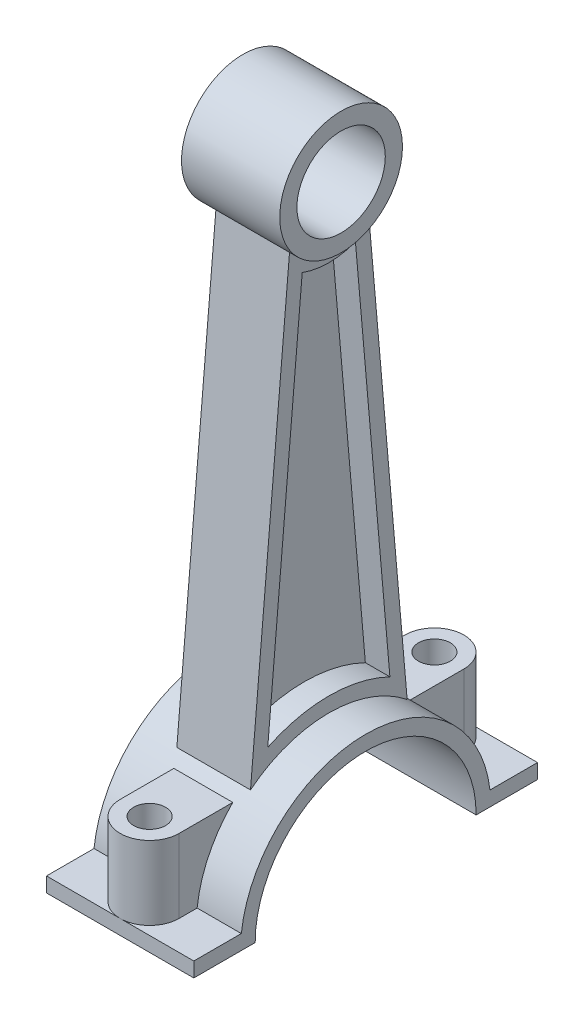
ISO-10303-21;
HEADER;
FILE_DESCRIPTION(('STEP AP214'),'2;1');
FILE_NAME('part.step','',(''),(''),'','','');
FILE_SCHEMA(('AUTOMOTIVE_DESIGN { 1 0 10303 214 1 1 1 1 }'));
ENDSEC;
DATA;
#1=APPLICATION_CONTEXT('core data for automotive mechanical design processes');
#2=APPLICATION_PROTOCOL_DEFINITION('international standard','automotive_design',2000,#1);
#3=PRODUCT_CONTEXT('',#1,'mechanical');
#4=PRODUCT('Part','Part','',(#3));
#5=PRODUCT_RELATED_PRODUCT_CATEGORY('part','',(#4));
#6=PRODUCT_DEFINITION_FORMATION('','',#4);
#7=PRODUCT_DEFINITION_CONTEXT('part definition',#1,'design');
#8=PRODUCT_DEFINITION('design','',#6,#7);
#9=PRODUCT_DEFINITION_SHAPE('','',#8);
#10=(LENGTH_UNIT() NAMED_UNIT(*) SI_UNIT(.MILLI.,.METRE.));
#11=(NAMED_UNIT(*) PLANE_ANGLE_UNIT() SI_UNIT($,.RADIAN.));
#12=(NAMED_UNIT(*) SI_UNIT($,.STERADIAN.) SOLID_ANGLE_UNIT());
#13=UNCERTAINTY_MEASURE_WITH_UNIT(LENGTH_MEASURE(1.E-05),#10,'distance_accuracy_value','');
#14=(GEOMETRIC_REPRESENTATION_CONTEXT(3) GLOBAL_UNCERTAINTY_ASSIGNED_CONTEXT((#13)) GLOBAL_UNIT_ASSIGNED_CONTEXT((#10,
#11,#12)) REPRESENTATION_CONTEXT('',''));
#15=CARTESIAN_POINT('',(0.,0.,0.));
#16=DIRECTION('',(0.,0.,1.));
#17=DIRECTION('',(1.,0.,0.));
#18=AXIS2_PLACEMENT_3D('',#15,#16,#17);
#19=CARTESIAN_POINT('',(7.5,0.,0.));
#20=DIRECTION('',(1.,0.,0.));
#21=DIRECTION('',(0.,0.,-1.));
#22=AXIS2_PLACEMENT_3D('',#19,#20,#21);
#23=PLANE('',#22);
#24=CARTESIAN_POINT('',(7.5,-120.4,0.));
#25=DIRECTION('',(1.,0.,0.));
#26=DIRECTION('',(0.,0.,-1.));
#27=AXIS2_PLACEMENT_3D('',#24,#25,#26);
#28=CIRCLE('',#27,25.5);
#29=CARTESIAN_POINT('',(7.5,-100.506382816849,-15.9528679355858));
#30=VERTEX_POINT('',#29);
#31=CARTESIAN_POINT('',(7.5,-100.506382816849,15.9528679355858));
#32=VERTEX_POINT('',#31);
#33=EDGE_CURVE('E426',#30,#32,#28,.T.);
#34=ORIENTED_EDGE('',*,*,#33,.F.);
#35=DIRECTION('',(0.,-0.996194698091746,-0.0871557427476582));
#36=VECTOR('',#35,1.);
#37=CARTESIAN_POINT('',(7.5,0.621634326986274,-7.10531287064495));
#38=LINE('',#37,#36);
#39=CARTESIAN_POINT('',(7.5,-9.60468635614928,-8.));
#40=VERTEX_POINT('',#39);
#41=EDGE_CURVE('E428',#40,#30,#38,.T.);
#42=ORIENTED_EDGE('',*,*,#41,.F.);
#43=CARTESIAN_POINT('',(7.5,0.,0.));
#44=DIRECTION('',(1.,0.,0.));
#45=DIRECTION('',(0.,0.,-1.));
#46=AXIS2_PLACEMENT_3D('',#43,#44,#45);
#47=CIRCLE('',#46,12.5);
#48=CARTESIAN_POINT('',(7.5,-9.60468635614928,8.));
#49=VERTEX_POINT('',#48);
#50=EDGE_CURVE('E432',#49,#40,#47,.T.);
#51=ORIENTED_EDGE('',*,*,#50,.F.);
#52=DIRECTION('',(0.,-0.996194698091746,0.0871557427476582));
#53=VECTOR('',#52,1.);
#54=CARTESIAN_POINT('',(7.5,0.621634326986274,7.10531287064495));
#55=LINE('',#54,#53);
#56=EDGE_CURVE('E434',#49,#32,#55,.T.);
#57=ORIENTED_EDGE('',*,*,#56,.T.);
#58=EDGE_LOOP('',(#34,#42,#51,#57));
#59=FACE_BOUND('',#58,.T.);
#60=DIRECTION('',(0.,-0.996194698091746,-0.0871557427476582));
#61=VECTOR('',#60,1.);
#62=CARTESIAN_POINT('',(7.5,0.360167098743299,-4.11672877636972));
#63=LINE('',#62,#61);
#64=CARTESIAN_POINT('',(7.5,-14.5219555829309,-5.41874580021823));
#65=VERTEX_POINT('',#64);
#66=CARTESIAN_POINT('',(7.5,-94.7575560761521,-12.4384512545701));
#67=VERTEX_POINT('',#66);
#68=EDGE_CURVE('E277',#65,#67,#63,.T.);
#69=ORIENTED_EDGE('',*,*,#68,.T.);
#70=CARTESIAN_POINT('',(7.5,-120.4,0.));
#71=DIRECTION('',(1.,0.,0.));
#72=DIRECTION('',(0.,0.,-1.));
#73=AXIS2_PLACEMENT_3D('',#70,#71,#72);
#74=CIRCLE('',#73,28.5);
#75=CARTESIAN_POINT('',(7.5,-94.7575560761521,12.4384512545701));
#76=VERTEX_POINT('',#75);
#77=EDGE_CURVE('E58',#67,#76,#74,.T.);
#78=ORIENTED_EDGE('',*,*,#77,.T.);
#79=DIRECTION('',(0.,-0.996194698091746,0.0871557427476582));
#80=VECTOR('',#79,1.);
#81=CARTESIAN_POINT('',(7.5,0.360167098743299,4.11672877636972));
#82=LINE('',#81,#80);
#83=CARTESIAN_POINT('',(7.5,-14.5219555829309,5.41874580021823));
#84=VERTEX_POINT('',#83);
#85=EDGE_CURVE('E268',#84,#76,#82,.T.);
#86=ORIENTED_EDGE('',*,*,#85,.F.);
#87=CARTESIAN_POINT('',(7.5,0.,0.));
#88=DIRECTION('',(1.,0.,0.));
#89=DIRECTION('',(0.,0.,-1.));
#90=AXIS2_PLACEMENT_3D('',#87,#88,#89);
#91=CIRCLE('',#90,15.5);
#92=EDGE_CURVE('E280',#84,#65,#91,.T.);
#93=ORIENTED_EDGE('',*,*,#92,.T.);
#94=EDGE_LOOP('',(#69,#78,#86,#93));
#95=FACE_BOUND('',#94,.T.);
#96=ADVANCED_FACE('F35',(#59,#95),#23,.T.);
#97=CARTESIAN_POINT('',(15.,-117.4,25.3229145242012));
#98=DIRECTION('',(0.,-1.,0.));
#99=DIRECTION('',(0.,0.,-1.));
#100=AXIS2_PLACEMENT_3D('',#97,#98,#99);
#101=PLANE('',#100);
#102=DIRECTION('',(-1.,0.,0.));
#103=VECTOR('',#102,1.);
#104=CARTESIAN_POINT('',(15.,-117.4,25.3229145242012));
#105=LINE('',#104,#103);
#106=CARTESIAN_POINT('',(15.,-117.4,25.3229145242012));
#107=VERTEX_POINT('',#106);
#108=CARTESIAN_POINT('',(6.,-117.4,25.3229145242012));
#109=VERTEX_POINT('',#108);
#110=EDGE_CURVE('E406',#107,#109,#105,.T.);
#111=ORIENTED_EDGE('',*,*,#110,.T.);
#112=DIRECTION('',(0.,0.,1.));
#113=VECTOR('',#112,1.);
#114=CARTESIAN_POINT('',(6.,-117.4,29.));
#115=LINE('',#114,#113);
#116=CARTESIAN_POINT('',(6.,-117.4,29.));
#117=VERTEX_POINT('',#116);
#118=EDGE_CURVE('E296',#109,#117,#115,.T.);
#119=ORIENTED_EDGE('',*,*,#118,.T.);
#120=CARTESIAN_POINT('',(0.,-117.4,29.));
#121=DIRECTION('',(0.,-1.,0.));
#122=DIRECTION('',(0.,0.,-1.));
#123=AXIS2_PLACEMENT_3D('',#120,#121,#122);
#124=CIRCLE('',#123,6.);
#125=CARTESIAN_POINT('',(0.,-117.4,35.));
#126=VERTEX_POINT('',#125);
#127=EDGE_CURVE('E302',#117,#126,#124,.T.);
#128=ORIENTED_EDGE('',*,*,#127,.T.);
#129=DIRECTION('',(-1.,0.,0.));
#130=VECTOR('',#129,1.);
#131=CARTESIAN_POINT('',(15.,-117.4,35.));
#132=LINE('',#131,#130);
#133=CARTESIAN_POINT('',(15.,-117.4,35.));
#134=VERTEX_POINT('',#133);
#135=EDGE_CURVE('E410',#134,#126,#132,.T.);
#136=ORIENTED_EDGE('',*,*,#135,.F.);
#137=DIRECTION('',(0.,0.,1.));
#138=VECTOR('',#137,1.);
#139=CARTESIAN_POINT('',(15.,-117.4,25.3229145242012));
#140=LINE('',#139,#138);
#141=EDGE_CURVE('E375',#107,#134,#140,.T.);
#142=ORIENTED_EDGE('',*,*,#141,.F.);
#143=EDGE_LOOP('',(#111,#119,#128,#136,#142));
#144=FACE_BOUND('',#143,.T.);
#145=ADVANCED_FACE('F516',(#144),#101,.F.);
#146=CARTESIAN_POINT('',(15.,-117.4,-25.3229145242012));
#147=DIRECTION('',(0.,1.,0.));
#148=DIRECTION('',(0.,0.,1.));
#149=AXIS2_PLACEMENT_3D('',#146,#147,#148);
#150=PLANE('',#149);
#151=CARTESIAN_POINT('',(0.,-117.4,-29.));
#152=DIRECTION('',(0.,1.,0.));
#153=DIRECTION('',(0.,0.,1.));
#154=AXIS2_PLACEMENT_3D('',#151,#152,#153);
#155=CIRCLE('',#154,6.);
#156=CARTESIAN_POINT('',(6.,-117.4,-29.));
#157=VERTEX_POINT('',#156);
#158=CARTESIAN_POINT('',(0.,-117.4,-35.));
#159=VERTEX_POINT('',#158);
#160=EDGE_CURVE('E344',#157,#159,#155,.T.);
#161=ORIENTED_EDGE('',*,*,#160,.F.);
#162=DIRECTION('',(0.,0.,-1.));
#163=VECTOR('',#162,1.);
#164=CARTESIAN_POINT('',(6.,-117.4,-29.));
#165=LINE('',#164,#163);
#166=CARTESIAN_POINT('',(6.,-117.4,-25.3229145242012));
#167=VERTEX_POINT('',#166);
#168=EDGE_CURVE('E331',#167,#157,#165,.T.);
#169=ORIENTED_EDGE('',*,*,#168,.F.);
#170=DIRECTION('',(-1.,0.,0.));
#171=VECTOR('',#170,1.);
#172=CARTESIAN_POINT('',(15.,-117.4,-25.3229145242012));
#173=LINE('',#172,#171);
#174=CARTESIAN_POINT('',(15.,-117.4,-25.3229145242012));
#175=VERTEX_POINT('',#174);
#176=EDGE_CURVE('E401',#175,#167,#173,.T.);
#177=ORIENTED_EDGE('',*,*,#176,.F.);
#178=DIRECTION('',(0.,0.,-1.));
#179=VECTOR('',#178,1.);
#180=CARTESIAN_POINT('',(15.,-117.4,-25.3229145242012));
#181=LINE('',#180,#179);
#182=CARTESIAN_POINT('',(15.,-117.4,-35.));
#183=VERTEX_POINT('',#182);
#184=EDGE_CURVE('E358',#175,#183,#181,.T.);
#185=ORIENTED_EDGE('',*,*,#184,.T.);
#186=DIRECTION('',(-1.,0.,0.));
#187=VECTOR('',#186,1.);
#188=CARTESIAN_POINT('',(15.,-117.4,-35.));
#189=LINE('',#188,#187);
#190=EDGE_CURVE('E423',#183,#159,#189,.T.);
#191=ORIENTED_EDGE('',*,*,#190,.T.);
#192=EDGE_LOOP('',(#161,#169,#177,#185,#191));
#193=FACE_BOUND('',#192,.T.);
#194=ADVANCED_FACE('F489',(#193),#150,.T.);
#195=DIRECTION('',(0.,0.,1.));
#196=VECTOR('',#195,1.);
#197=CARTESIAN_POINT('',(-6.,-117.4,-29.));
#198=LINE('',#197,#196);
#199=CARTESIAN_POINT('',(-6.,-117.4,-29.));
#200=VERTEX_POINT('',#199);
#201=CARTESIAN_POINT('',(-6.,-117.4,-25.3229145242012));
#202=VERTEX_POINT('',#201);
#203=EDGE_CURVE('E337',#200,#202,#198,.T.);
#204=ORIENTED_EDGE('',*,*,#203,.F.);
#205=EDGE_CURVE('E343',#159,#200,#155,.T.);
#206=ORIENTED_EDGE('',*,*,#205,.F.);
#207=CARTESIAN_POINT('',(-15.,-117.4,-35.));
#208=VERTEX_POINT('',#207);
#209=EDGE_CURVE('E379',#159,#208,#189,.T.);
#210=ORIENTED_EDGE('',*,*,#209,.T.);
#211=DIRECTION('',(0.,0.,-1.));
#212=VECTOR('',#211,1.);
#213=CARTESIAN_POINT('',(-15.,-117.4,-25.3229145242012));
#214=LINE('',#213,#212);
#215=CARTESIAN_POINT('',(-15.,-117.4,-25.3229145242012));
#216=VERTEX_POINT('',#215);
#217=EDGE_CURVE('E357',#216,#208,#214,.T.);
#218=ORIENTED_EDGE('',*,*,#217,.F.);
#219=EDGE_CURVE('E405',#202,#216,#173,.T.);
#220=ORIENTED_EDGE('',*,*,#219,.F.);
#221=EDGE_LOOP('',(#204,#206,#210,#218,#220));
#222=FACE_BOUND('',#221,.T.);
#223=ADVANCED_FACE('F500',(#222),#150,.T.);
#224=CARTESIAN_POINT('',(15.,-120.4,0.));
#225=DIRECTION('',(-1.,0.,0.));
#226=DIRECTION('',(0.,0.,1.));
#227=AXIS2_PLACEMENT_3D('',#224,#225,#226);
#228=CYLINDRICAL_SURFACE('',#227,25.5);
#229=ORIENTED_EDGE('',*,*,#33,.T.);
#230=DIRECTION('',(-1.,0.,0.));
#231=VECTOR('',#230,1.);
#232=CARTESIAN_POINT('',(7.5,-100.506382816849,15.9528679355858));
#233=LINE('',#232,#231);
#234=CARTESIAN_POINT('',(-7.5,-100.506382816849,15.9528679355858));
#235=VERTEX_POINT('',#234);
#236=EDGE_CURVE('E437',#32,#235,#233,.T.);
#237=ORIENTED_EDGE('',*,*,#236,.T.);
#238=CARTESIAN_POINT('',(-7.5,-120.4,0.));
#239=DIRECTION('',(1.,0.,0.));
#240=DIRECTION('',(0.,0.,-1.));
#241=AXIS2_PLACEMENT_3D('',#238,#239,#240);
#242=CIRCLE('',#241,25.5);
#243=CARTESIAN_POINT('',(-7.5,-100.506382816849,-15.9528679355859));
#244=VERTEX_POINT('',#243);
#245=EDGE_CURVE('E404',#244,#235,#242,.T.);
#246=ORIENTED_EDGE('',*,*,#245,.F.);
#247=DIRECTION('',(-1.,0.,0.));
#248=VECTOR('',#247,1.);
#249=CARTESIAN_POINT('',(7.5,-100.506382816849,-15.9528679355858));
#250=LINE('',#249,#248);
#251=EDGE_CURVE('E454',#30,#244,#250,.T.);
#252=ORIENTED_EDGE('',*,*,#251,.F.);
#253=EDGE_LOOP('',(#229,#237,#246,#252));
#254=FACE_BOUND('',#253,.T.);
#255=DIRECTION('',(-1.,0.,0.));
#256=VECTOR('',#255,1.);
#257=CARTESIAN_POINT('',(15.,-102.4,18.0623918681884));
#258=LINE('',#257,#256);
#259=CARTESIAN_POINT('',(-6.,-102.4,18.0623918681884));
#260=VERTEX_POINT('',#259);
#261=CARTESIAN_POINT('',(6.,-102.4,18.0623918681884));
#262=VERTEX_POINT('',#261);
#263=EDGE_CURVE('E11',#260,#262,#258,.F.);
#264=ORIENTED_EDGE('',*,*,#263,.T.);
#265=CARTESIAN_POINT('',(6.,-120.4,0.));
#266=DIRECTION('',(1.,0.,0.));
#267=DIRECTION('',(0.,0.,-1.));
#268=AXIS2_PLACEMENT_3D('',#265,#266,#267);
#269=CIRCLE('',#268,25.5);
#270=EDGE_CURVE('E324',#262,#109,#269,.T.);
#271=ORIENTED_EDGE('',*,*,#270,.T.);
#272=ORIENTED_EDGE('',*,*,#110,.F.);
#273=CARTESIAN_POINT('',(15.,-120.4,0.));
#274=DIRECTION('',(1.,0.,0.));
#275=DIRECTION('',(0.,0.,-1.));
#276=AXIS2_PLACEMENT_3D('',#273,#274,#275);
#277=CIRCLE('',#276,25.5);
#278=EDGE_CURVE('E377',#175,#107,#277,.T.);
#279=ORIENTED_EDGE('',*,*,#278,.F.);
#280=ORIENTED_EDGE('',*,*,#176,.T.);
#281=CARTESIAN_POINT('',(6.,-120.4,0.));
#282=DIRECTION('',(-1.,0.,0.));
#283=DIRECTION('',(0.,0.,1.));
#284=AXIS2_PLACEMENT_3D('',#281,#282,#283);
#285=CIRCLE('',#284,25.5);
#286=CARTESIAN_POINT('',(6.,-102.4,-18.0623918681884));
#287=VERTEX_POINT('',#286);
#288=EDGE_CURVE('E355',#287,#167,#285,.T.);
#289=ORIENTED_EDGE('',*,*,#288,.F.);
#290=DIRECTION('',(-1.,0.,0.));
#291=VECTOR('',#290,1.);
#292=CARTESIAN_POINT('',(15.,-102.4,-18.0623918681884));
#293=LINE('',#292,#291);
#294=CARTESIAN_POINT('',(-6.,-102.4,-18.0623918681884));
#295=VERTEX_POINT('',#294);
#296=EDGE_CURVE('E43',#287,#295,#293,.T.);
#297=ORIENTED_EDGE('',*,*,#296,.T.);
#298=CARTESIAN_POINT('',(-5.99999999999999,-120.4,0.));
#299=DIRECTION('',(1.,0.,0.));
#300=DIRECTION('',(0.,0.,-1.));
#301=AXIS2_PLACEMENT_3D('',#298,#299,#300);
#302=CIRCLE('',#301,25.5);
#303=EDGE_CURVE('E352',#202,#295,#302,.T.);
#304=ORIENTED_EDGE('',*,*,#303,.F.);
#305=ORIENTED_EDGE('',*,*,#219,.T.);
#306=CARTESIAN_POINT('',(-15.,-120.4,0.));
#307=DIRECTION('',(1.,0.,0.));
#308=DIRECTION('',(0.,0.,-1.));
#309=AXIS2_PLACEMENT_3D('',#306,#307,#308);
#310=CIRCLE('',#309,25.5);
#311=CARTESIAN_POINT('',(-15.,-117.4,25.3229145242012));
#312=VERTEX_POINT('',#311);
#313=EDGE_CURVE('E362',#216,#312,#310,.T.);
#314=ORIENTED_EDGE('',*,*,#313,.T.);
#315=CARTESIAN_POINT('',(-6.,-117.4,25.3229145242012));
#316=VERTEX_POINT('',#315);
#317=EDGE_CURVE('E409',#316,#312,#105,.T.);
#318=ORIENTED_EDGE('',*,*,#317,.F.);
#319=CARTESIAN_POINT('',(-5.99999999999999,-120.4,0.));
#320=DIRECTION('',(-1.,0.,0.));
#321=DIRECTION('',(0.,0.,1.));
#322=AXIS2_PLACEMENT_3D('',#319,#320,#321);
#323=CIRCLE('',#322,25.5);
#324=EDGE_CURVE('E321',#316,#260,#323,.T.);
#325=ORIENTED_EDGE('',*,*,#324,.T.);
#326=EDGE_LOOP('',(#264,#271,#272,#279,#280,#289,#297,#304,#305,#314,#318,#325));
#327=FACE_BOUND('',#326,.T.);
#328=ADVANCED_FACE('F472',(#254,#327),#228,.T.);
#329=CARTESIAN_POINT('',(15.,-120.4,0.));
#330=DIRECTION('',(-1.,0.,0.));
#331=DIRECTION('',(0.,0.,1.));
#332=AXIS2_PLACEMENT_3D('',#329,#330,#331);
#333=CYLINDRICAL_SURFACE('',#332,22.5);
#334=CARTESIAN_POINT('',(-15.,-120.4,0.));
#335=DIRECTION('',(1.,0.,0.));
#336=DIRECTION('',(0.,0.,-1.));
#337=AXIS2_PLACEMENT_3D('',#334,#335,#336);
#338=CIRCLE('',#337,22.5);
#339=CARTESIAN_POINT('',(-15.,-120.4,-22.5));
#340=VERTEX_POINT('',#339);
#341=CARTESIAN_POINT('',(-15.,-120.4,22.5));
#342=VERTEX_POINT('',#341);
#343=EDGE_CURVE('E387',#340,#342,#338,.T.);
#344=ORIENTED_EDGE('',*,*,#343,.F.);
#345=DIRECTION('',(-1.,0.,0.));
#346=VECTOR('',#345,1.);
#347=CARTESIAN_POINT('',(15.,-120.4,-22.5));
#348=LINE('',#347,#346);
#349=CARTESIAN_POINT('',(15.,-120.4,-22.5));
#350=VERTEX_POINT('',#349);
#351=EDGE_CURVE('E418',#350,#340,#348,.T.);
#352=ORIENTED_EDGE('',*,*,#351,.F.);
#353=CARTESIAN_POINT('',(15.,-120.4,0.));
#354=DIRECTION('',(1.,0.,0.));
#355=DIRECTION('',(0.,0.,-1.));
#356=AXIS2_PLACEMENT_3D('',#353,#354,#355);
#357=CIRCLE('',#356,22.5);
#358=CARTESIAN_POINT('',(15.,-120.4,22.5));
#359=VERTEX_POINT('',#358);
#360=EDGE_CURVE('E366',#350,#359,#357,.T.);
#361=ORIENTED_EDGE('',*,*,#360,.T.);
#362=DIRECTION('',(-1.,0.,0.));
#363=VECTOR('',#362,1.);
#364=CARTESIAN_POINT('',(15.,-120.4,22.5));
#365=LINE('',#364,#363);
#366=EDGE_CURVE('E416',#359,#342,#365,.T.);
#367=ORIENTED_EDGE('',*,*,#366,.T.);
#368=EDGE_LOOP('',(#344,#352,#361,#367));
#369=FACE_BOUND('',#368,.T.);
#370=ADVANCED_FACE('F557',(#369),#333,.F.);
#371=CARTESIAN_POINT('',(10.,0.,0.));
#372=DIRECTION('',(-1.,0.,0.));
#373=DIRECTION('',(0.,0.,1.));
#374=AXIS2_PLACEMENT_3D('',#371,#372,#373);
#375=CYLINDRICAL_SURFACE('',#374,12.5);
#376=DIRECTION('',(-1.,0.,0.));
#377=VECTOR('',#376,1.);
#378=CARTESIAN_POINT('',(7.5,-9.60468635614928,8.));
#379=LINE('',#378,#377);
#380=CARTESIAN_POINT('',(-7.5,-9.60468635614928,8.));
#381=VERTEX_POINT('',#380);
#382=EDGE_CURVE('E449',#49,#381,#379,.T.);
#383=ORIENTED_EDGE('',*,*,#382,.F.);
#384=ORIENTED_EDGE('',*,*,#50,.T.);
#385=DIRECTION('',(-1.,0.,0.));
#386=VECTOR('',#385,1.);
#387=CARTESIAN_POINT('',(7.5,-9.60468635614928,-8.));
#388=LINE('',#387,#386);
#389=CARTESIAN_POINT('',(-7.5,-9.60468635614928,-8.));
#390=VERTEX_POINT('',#389);
#391=EDGE_CURVE('E452',#40,#390,#388,.T.);
#392=ORIENTED_EDGE('',*,*,#391,.T.);
#393=CARTESIAN_POINT('',(-7.5,0.,0.));
#394=DIRECTION('',(1.,0.,0.));
#395=DIRECTION('',(0.,0.,-1.));
#396=AXIS2_PLACEMENT_3D('',#393,#394,#395);
#397=CIRCLE('',#396,12.5);
#398=EDGE_CURVE('E443',#381,#390,#397,.T.);
#399=ORIENTED_EDGE('',*,*,#398,.F.);
#400=EDGE_LOOP('',(#383,#384,#392,#399));
#401=FACE_BOUND('',#400,.T.);
#402=CARTESIAN_POINT('',(10.,0.,0.));
#403=DIRECTION('',(1.,0.,0.));
#404=DIRECTION('',(0.,0.,-1.));
#405=AXIS2_PLACEMENT_3D('',#402,#403,#404);
#406=CIRCLE('',#405,12.5);
#407=CARTESIAN_POINT('',(10.,0.,-12.5));
#408=VERTEX_POINT('',#407);
#409=EDGE_CURVE('E458',#408,#408,#406,.T.);
#410=ORIENTED_EDGE('',*,*,#409,.F.);
#411=EDGE_LOOP('',(#410));
#412=FACE_BOUND('',#411,.T.);
#413=CARTESIAN_POINT('',(-10.,0.,0.));
#414=DIRECTION('',(1.,0.,0.));
#415=DIRECTION('',(0.,0.,-1.));
#416=AXIS2_PLACEMENT_3D('',#413,#414,#415);
#417=CIRCLE('',#416,12.5);
#418=CARTESIAN_POINT('',(-10.,0.,-12.5));
#419=VERTEX_POINT('',#418);
#420=EDGE_CURVE('E457',#419,#419,#417,.T.);
#421=ORIENTED_EDGE('',*,*,#420,.T.);
#422=EDGE_LOOP('',(#421));
#423=FACE_BOUND('',#422,.T.);
#424=ADVANCED_FACE('F37',(#401,#412,#423),#375,.T.);
#425=CARTESIAN_POINT('',(10.,0.,0.));
#426=DIRECTION('',(-1.,0.,0.));
#427=DIRECTION('',(0.,0.,1.));
#428=AXIS2_PLACEMENT_3D('',#425,#426,#427);
#429=CYLINDRICAL_SURFACE('',#428,9.);
#430=CARTESIAN_POINT('',(10.,0.,0.));
#431=DIRECTION('',(1.,0.,0.));
#432=DIRECTION('',(0.,0.,-1.));
#433=AXIS2_PLACEMENT_3D('',#430,#431,#432);
#434=CIRCLE('',#433,9.);
#435=CARTESIAN_POINT('',(10.,0.,-9.));
#436=VERTEX_POINT('',#435);
#437=EDGE_CURVE('E461',#436,#436,#434,.T.);
#438=ORIENTED_EDGE('',*,*,#437,.T.);
#439=EDGE_LOOP('',(#438));
#440=FACE_BOUND('',#439,.T.);
#441=CARTESIAN_POINT('',(-10.,0.,0.));
#442=DIRECTION('',(1.,0.,0.));
#443=DIRECTION('',(0.,0.,-1.));
#444=AXIS2_PLACEMENT_3D('',#441,#442,#443);
#445=CIRCLE('',#444,9.);
#446=CARTESIAN_POINT('',(-10.,0.,-9.));
#447=VERTEX_POINT('',#446);
#448=EDGE_CURVE('E462',#447,#447,#445,.T.);
#449=ORIENTED_EDGE('',*,*,#448,.F.);
#450=EDGE_LOOP('',(#449));
#451=FACE_BOUND('',#450,.T.);
#452=ADVANCED_FACE('F548',(#440,#451),#429,.F.);
#453=CARTESIAN_POINT('',(10.,0.,0.));
#454=DIRECTION('',(1.,0.,0.));
#455=DIRECTION('',(0.,0.,-1.));
#456=AXIS2_PLACEMENT_3D('',#453,#454,#455);
#457=PLANE('',#456);
#458=ORIENTED_EDGE('',*,*,#409,.T.);
#459=EDGE_LOOP('',(#458));
#460=FACE_BOUND('',#459,.T.);
#461=ORIENTED_EDGE('',*,*,#437,.F.);
#462=EDGE_LOOP('',(#461));
#463=FACE_BOUND('',#462,.T.);
#464=ADVANCED_FACE('F545',(#460,#463),#457,.T.);
#465=CARTESIAN_POINT('',(-10.,0.,0.));
#466=DIRECTION('',(1.,0.,0.));
#467=DIRECTION('',(0.,0.,-1.));
#468=AXIS2_PLACEMENT_3D('',#465,#466,#467);
#469=PLANE('',#468);
#470=ORIENTED_EDGE('',*,*,#420,.F.);
#471=EDGE_LOOP('',(#470));
#472=FACE_BOUND('',#471,.T.);
#473=ORIENTED_EDGE('',*,*,#448,.T.);
#474=EDGE_LOOP('',(#473));
#475=FACE_BOUND('',#474,.T.);
#476=ADVANCED_FACE('F543',(#472,#475),#469,.F.);
#477=CARTESIAN_POINT('',(7.5,0.621634326986274,-7.10531287064495));
#478=DIRECTION('',(0.,0.0871557427476582,-0.996194698091746));
#479=DIRECTION('',(0.,0.996194698091746,0.0871557427476582));
#480=AXIS2_PLACEMENT_3D('',#477,#478,#479);
#481=PLANE('',#480);
#482=DIRECTION('',(0.,-0.996194698091746,-0.0871557427476582));
#483=VECTOR('',#482,1.);
#484=CARTESIAN_POINT('',(-7.5,0.621634326986274,-7.10531287064495));
#485=LINE('',#484,#483);
#486=EDGE_CURVE('E440',#390,#244,#485,.T.);
#487=ORIENTED_EDGE('',*,*,#486,.F.);
#488=ORIENTED_EDGE('',*,*,#391,.F.);
#489=ORIENTED_EDGE('',*,*,#41,.T.);
#490=ORIENTED_EDGE('',*,*,#251,.T.);
#491=EDGE_LOOP('',(#487,#488,#489,#490));
#492=FACE_BOUND('',#491,.T.);
#493=ADVANCED_FACE('F539',(#492),#481,.T.);
#494=CARTESIAN_POINT('',(7.5,0.621634326986274,7.10531287064495));
#495=DIRECTION('',(0.,-0.0871557427476582,-0.996194698091746));
#496=DIRECTION('',(0.,0.996194698091746,-0.0871557427476582));
#497=AXIS2_PLACEMENT_3D('',#494,#495,#496);
#498=PLANE('',#497);
#499=DIRECTION('',(0.,-0.996194698091746,0.0871557427476582));
#500=VECTOR('',#499,1.);
#501=CARTESIAN_POINT('',(-7.5,0.621634326986274,7.10531287064495));
#502=LINE('',#501,#500);
#503=EDGE_CURVE('E429',#381,#235,#502,.T.);
#504=ORIENTED_EDGE('',*,*,#503,.T.);
#505=ORIENTED_EDGE('',*,*,#236,.F.);
#506=ORIENTED_EDGE('',*,*,#56,.F.);
#507=ORIENTED_EDGE('',*,*,#382,.T.);
#508=EDGE_LOOP('',(#504,#505,#506,#507));
#509=FACE_BOUND('',#508,.T.);
#510=ADVANCED_FACE('F535',(#509),#498,.F.);
#511=CARTESIAN_POINT('',(-7.5,0.,0.));
#512=DIRECTION('',(1.,0.,0.));
#513=DIRECTION('',(0.,0.,-1.));
#514=AXIS2_PLACEMENT_3D('',#511,#512,#513);
#515=PLANE('',#514);
#516=DIRECTION('',(0.,-0.996194698091746,0.0871557427476582));
#517=VECTOR('',#516,1.);
#518=CARTESIAN_POINT('',(-7.5,0.360167098743299,4.11672877636972));
#519=LINE('',#518,#517);
#520=CARTESIAN_POINT('',(-7.5,-14.5219555829309,5.41874580021823));
#521=VERTEX_POINT('',#520);
#522=CARTESIAN_POINT('',(-7.5,-94.7575560761521,12.4384512545701));
#523=VERTEX_POINT('',#522);
#524=EDGE_CURVE('E256',#521,#523,#519,.T.);
#525=ORIENTED_EDGE('',*,*,#524,.T.);
#526=CARTESIAN_POINT('',(-7.5,-120.4,0.));
#527=DIRECTION('',(1.,0.,0.));
#528=DIRECTION('',(0.,0.,-1.));
#529=AXIS2_PLACEMENT_3D('',#526,#527,#528);
#530=CIRCLE('',#529,28.5);
#531=CARTESIAN_POINT('',(-7.5,-94.7575560761521,-12.4384512545701));
#532=VERTEX_POINT('',#531);
#533=EDGE_CURVE('E50',#532,#523,#530,.T.);
#534=ORIENTED_EDGE('',*,*,#533,.F.);
#535=DIRECTION('',(0.,-0.996194698091746,-0.0871557427476582));
#536=VECTOR('',#535,1.);
#537=CARTESIAN_POINT('',(-7.5,0.360167098743299,-4.11672877636972));
#538=LINE('',#537,#536);
#539=CARTESIAN_POINT('',(-7.5,-14.5219555829309,-5.41874580021823));
#540=VERTEX_POINT('',#539);
#541=EDGE_CURVE('E247',#540,#532,#538,.T.);
#542=ORIENTED_EDGE('',*,*,#541,.F.);
#543=CARTESIAN_POINT('',(-7.5,0.,0.));
#544=DIRECTION('',(1.,0.,0.));
#545=DIRECTION('',(0.,0.,-1.));
#546=AXIS2_PLACEMENT_3D('',#543,#544,#545);
#547=CIRCLE('',#546,15.5);
#548=EDGE_CURVE('E250',#521,#540,#547,.T.);
#549=ORIENTED_EDGE('',*,*,#548,.F.);
#550=EDGE_LOOP('',(#525,#534,#542,#549));
#551=FACE_BOUND('',#550,.T.);
#552=ORIENTED_EDGE('',*,*,#245,.T.);
#553=ORIENTED_EDGE('',*,*,#503,.F.);
#554=ORIENTED_EDGE('',*,*,#398,.T.);
#555=ORIENTED_EDGE('',*,*,#486,.T.);
#556=EDGE_LOOP('',(#552,#553,#554,#555));
#557=FACE_BOUND('',#556,.T.);
#558=ADVANCED_FACE('F532',(#551,#557),#515,.F.);
#559=CARTESIAN_POINT('',(-6.,-117.4,29.));
#560=VERTEX_POINT('',#559);
#561=EDGE_CURVE('E314',#126,#560,#124,.T.);
#562=ORIENTED_EDGE('',*,*,#561,.T.);
#563=DIRECTION('',(0.,0.,-1.));
#564=VECTOR('',#563,1.);
#565=CARTESIAN_POINT('',(-6.,-117.4,29.));
#566=LINE('',#565,#564);
#567=EDGE_CURVE('E311',#560,#316,#566,.T.);
#568=ORIENTED_EDGE('',*,*,#567,.T.);
#569=ORIENTED_EDGE('',*,*,#317,.T.);
#570=DIRECTION('',(0.,0.,1.));
#571=VECTOR('',#570,1.);
#572=CARTESIAN_POINT('',(-15.,-117.4,25.3229145242012));
#573=LINE('',#572,#571);
#574=CARTESIAN_POINT('',(-15.,-117.4,35.));
#575=VERTEX_POINT('',#574);
#576=EDGE_CURVE('E396',#312,#575,#573,.T.);
#577=ORIENTED_EDGE('',*,*,#576,.T.);
#578=EDGE_CURVE('E413',#126,#575,#132,.T.);
#579=ORIENTED_EDGE('',*,*,#578,.F.);
#580=EDGE_LOOP('',(#562,#568,#569,#577,#579));
#581=FACE_BOUND('',#580,.T.);
#582=ADVANCED_FACE('F526',(#581),#101,.F.);
#583=CARTESIAN_POINT('',(15.,-120.4,35.));
#584=DIRECTION('',(0.,0.,1.));
#585=DIRECTION('',(1.,0.,0.));
#586=AXIS2_PLACEMENT_3D('',#583,#584,#585);
#587=PLANE('',#586);
#588=DIRECTION('',(0.,1.,0.));
#589=VECTOR('',#588,1.);
#590=CARTESIAN_POINT('',(-15.,-120.4,35.));
#591=LINE('',#590,#589);
#592=CARTESIAN_POINT('',(-15.,-120.4,35.));
#593=VERTEX_POINT('',#592);
#594=EDGE_CURVE('E393',#593,#575,#591,.T.);
#595=ORIENTED_EDGE('',*,*,#594,.F.);
#596=DIRECTION('',(-1.,0.,0.));
#597=VECTOR('',#596,1.);
#598=CARTESIAN_POINT('',(15.,-120.4,35.));
#599=LINE('',#598,#597);
#600=CARTESIAN_POINT('',(15.,-120.4,35.));
#601=VERTEX_POINT('',#600);
#602=EDGE_CURVE('E414',#601,#593,#599,.T.);
#603=ORIENTED_EDGE('',*,*,#602,.F.);
#604=DIRECTION('',(0.,1.,0.));
#605=VECTOR('',#604,1.);
#606=CARTESIAN_POINT('',(15.,-120.4,35.));
#607=LINE('',#606,#605);
#608=EDGE_CURVE('E372',#601,#134,#607,.T.);
#609=ORIENTED_EDGE('',*,*,#608,.T.);
#610=ORIENTED_EDGE('',*,*,#135,.T.);
#611=ORIENTED_EDGE('',*,*,#578,.T.);
#612=EDGE_LOOP('',(#595,#603,#609,#610,#611));
#613=FACE_BOUND('',#612,.T.);
#614=ADVANCED_FACE('F592',(#613),#587,.T.);
#615=CARTESIAN_POINT('',(15.,-120.4,22.5));
#616=DIRECTION('',(0.,-1.,0.));
#617=DIRECTION('',(0.,0.,-1.));
#618=AXIS2_PLACEMENT_3D('',#615,#616,#617);
#619=PLANE('',#618);
#620=CARTESIAN_POINT('',(0.,-120.4,29.));
#621=DIRECTION('',(0.,-1.,0.));
#622=DIRECTION('',(0.,0.,-1.));
#623=AXIS2_PLACEMENT_3D('',#620,#621,#622);
#624=CIRCLE('',#623,3.25);
#625=CARTESIAN_POINT('',(0.,-120.4,25.75));
#626=VERTEX_POINT('',#625);
#627=EDGE_CURVE('E293',#626,#626,#624,.T.);
#628=ORIENTED_EDGE('',*,*,#627,.F.);
#629=EDGE_LOOP('',(#628));
#630=FACE_BOUND('',#629,.T.);
#631=DIRECTION('',(0.,0.,1.));
#632=VECTOR('',#631,1.);
#633=CARTESIAN_POINT('',(-15.,-120.4,22.5));
#634=LINE('',#633,#632);
#635=EDGE_CURVE('E390',#342,#593,#634,.T.);
#636=ORIENTED_EDGE('',*,*,#635,.F.);
#637=ORIENTED_EDGE('',*,*,#366,.F.);
#638=DIRECTION('',(0.,0.,1.));
#639=VECTOR('',#638,1.);
#640=CARTESIAN_POINT('',(15.,-120.4,22.5));
#641=LINE('',#640,#639);
#642=EDGE_CURVE('E369',#359,#601,#641,.T.);
#643=ORIENTED_EDGE('',*,*,#642,.T.);
#644=ORIENTED_EDGE('',*,*,#602,.T.);
#645=EDGE_LOOP('',(#636,#637,#643,#644));
#646=FACE_BOUND('',#645,.T.);
#647=ADVANCED_FACE('F596',(#630,#646),#619,.T.);
#648=CARTESIAN_POINT('',(15.,-120.4,-22.5));
#649=DIRECTION('',(0.,1.,0.));
#650=DIRECTION('',(0.,0.,1.));
#651=AXIS2_PLACEMENT_3D('',#648,#649,#650);
#652=PLANE('',#651);
#653=CARTESIAN_POINT('',(0.,-120.4,-29.));
#654=DIRECTION('',(0.,1.,0.));
#655=DIRECTION('',(0.,0.,1.));
#656=AXIS2_PLACEMENT_3D('',#653,#654,#655);
#657=CIRCLE('',#656,3.25);
#658=CARTESIAN_POINT('',(0.,-120.4,-25.75));
#659=VERTEX_POINT('',#658);
#660=EDGE_CURVE('E328',#659,#659,#657,.T.);
#661=ORIENTED_EDGE('',*,*,#660,.T.);
#662=EDGE_LOOP('',(#661));
#663=FACE_BOUND('',#662,.T.);
#664=DIRECTION('',(0.,0.,-1.));
#665=VECTOR('',#664,1.);
#666=CARTESIAN_POINT('',(-15.,-120.4,-22.5));
#667=LINE('',#666,#665);
#668=CARTESIAN_POINT('',(-15.,-120.4,-35.));
#669=VERTEX_POINT('',#668);
#670=EDGE_CURVE('E385',#340,#669,#667,.T.);
#671=ORIENTED_EDGE('',*,*,#670,.T.);
#672=DIRECTION('',(-1.,0.,0.));
#673=VECTOR('',#672,1.);
#674=CARTESIAN_POINT('',(15.,-120.4,-35.));
#675=LINE('',#674,#673);
#676=CARTESIAN_POINT('',(15.,-120.4,-35.));
#677=VERTEX_POINT('',#676);
#678=EDGE_CURVE('E420',#677,#669,#675,.T.);
#679=ORIENTED_EDGE('',*,*,#678,.F.);
#680=DIRECTION('',(0.,0.,-1.));
#681=VECTOR('',#680,1.);
#682=CARTESIAN_POINT('',(15.,-120.4,-22.5));
#683=LINE('',#682,#681);
#684=EDGE_CURVE('E364',#350,#677,#683,.T.);
#685=ORIENTED_EDGE('',*,*,#684,.F.);
#686=ORIENTED_EDGE('',*,*,#351,.T.);
#687=EDGE_LOOP('',(#671,#679,#685,#686));
#688=FACE_BOUND('',#687,.T.);
#689=ADVANCED_FACE('F599',(#663,#688),#652,.F.);
#690=CARTESIAN_POINT('',(15.,-120.4,-35.));
#691=DIRECTION('',(0.,0.,1.));
#692=DIRECTION('',(1.,0.,0.));
#693=AXIS2_PLACEMENT_3D('',#690,#691,#692);
#694=PLANE('',#693);
#695=DIRECTION('',(0.,1.,0.));
#696=VECTOR('',#695,1.);
#697=CARTESIAN_POINT('',(-15.,-120.4,-35.));
#698=LINE('',#697,#696);
#699=EDGE_CURVE('E382',#669,#208,#698,.T.);
#700=ORIENTED_EDGE('',*,*,#699,.T.);
#701=ORIENTED_EDGE('',*,*,#209,.F.);
#702=ORIENTED_EDGE('',*,*,#190,.F.);
#703=DIRECTION('',(0.,1.,0.));
#704=VECTOR('',#703,1.);
#705=CARTESIAN_POINT('',(15.,-120.4,-35.));
#706=LINE('',#705,#704);
#707=EDGE_CURVE('E361',#677,#183,#706,.T.);
#708=ORIENTED_EDGE('',*,*,#707,.F.);
#709=ORIENTED_EDGE('',*,*,#678,.T.);
#710=EDGE_LOOP('',(#700,#701,#702,#708,#709));
#711=FACE_BOUND('',#710,.T.);
#712=ADVANCED_FACE('F495',(#711),#694,.F.);
#713=CARTESIAN_POINT('',(15.,-120.4,0.));
#714=DIRECTION('',(1.,0.,0.));
#715=DIRECTION('',(0.,0.,-1.));
#716=AXIS2_PLACEMENT_3D('',#713,#714,#715);
#717=PLANE('',#716);
#718=ORIENTED_EDGE('',*,*,#184,.F.);
#719=ORIENTED_EDGE('',*,*,#278,.T.);
#720=ORIENTED_EDGE('',*,*,#141,.T.);
#721=ORIENTED_EDGE('',*,*,#608,.F.);
#722=ORIENTED_EDGE('',*,*,#642,.F.);
#723=ORIENTED_EDGE('',*,*,#360,.F.);
#724=ORIENTED_EDGE('',*,*,#684,.T.);
#725=ORIENTED_EDGE('',*,*,#707,.T.);
#726=EDGE_LOOP('',(#718,#719,#720,#721,#722,#723,#724,#725));
#727=FACE_BOUND('',#726,.T.);
#728=ADVANCED_FACE('F605',(#727),#717,.T.);
#729=CARTESIAN_POINT('',(-15.,-120.4,0.));
#730=DIRECTION('',(1.,0.,0.));
#731=DIRECTION('',(0.,0.,-1.));
#732=AXIS2_PLACEMENT_3D('',#729,#730,#731);
#733=PLANE('',#732);
#734=ORIENTED_EDGE('',*,*,#217,.T.);
#735=ORIENTED_EDGE('',*,*,#699,.F.);
#736=ORIENTED_EDGE('',*,*,#670,.F.);
#737=ORIENTED_EDGE('',*,*,#343,.T.);
#738=ORIENTED_EDGE('',*,*,#635,.T.);
#739=ORIENTED_EDGE('',*,*,#594,.T.);
#740=ORIENTED_EDGE('',*,*,#576,.F.);
#741=ORIENTED_EDGE('',*,*,#313,.F.);
#742=EDGE_LOOP('',(#734,#735,#736,#737,#738,#739,#740,#741));
#743=FACE_BOUND('',#742,.T.);
#744=ADVANCED_FACE('F589',(#743),#733,.F.);
#745=CARTESIAN_POINT('',(0.,-102.4,-29.));
#746=DIRECTION('',(0.,1.,0.));
#747=DIRECTION('',(0.,0.,1.));
#748=AXIS2_PLACEMENT_3D('',#745,#746,#747);
#749=PLANE('',#748);
#750=CARTESIAN_POINT('',(0.,-102.4,-29.));
#751=DIRECTION('',(0.,1.,0.));
#752=DIRECTION('',(0.,0.,1.));
#753=AXIS2_PLACEMENT_3D('',#750,#751,#752);
#754=CIRCLE('',#753,3.25);
#755=CARTESIAN_POINT('',(0.,-102.4,-25.75));
#756=VERTEX_POINT('',#755);
#757=EDGE_CURVE('E327',#756,#756,#754,.T.);
#758=ORIENTED_EDGE('',*,*,#757,.F.);
#759=EDGE_LOOP('',(#758));
#760=FACE_BOUND('',#759,.T.);
#761=ORIENTED_EDGE('',*,*,#296,.F.);
#762=DIRECTION('',(0.,0.,-1.));
#763=VECTOR('',#762,1.);
#764=CARTESIAN_POINT('',(6.,-102.4,-29.));
#765=LINE('',#764,#763);
#766=CARTESIAN_POINT('',(6.,-102.4,-29.));
#767=VERTEX_POINT('',#766);
#768=EDGE_CURVE('E334',#287,#767,#765,.T.);
#769=ORIENTED_EDGE('',*,*,#768,.T.);
#770=CARTESIAN_POINT('',(0.,-102.4,-29.));
#771=DIRECTION('',(0.,1.,0.));
#772=DIRECTION('',(0.,0.,1.));
#773=AXIS2_PLACEMENT_3D('',#770,#771,#772);
#774=CIRCLE('',#773,6.);
#775=CARTESIAN_POINT('',(-6.,-102.4,-29.));
#776=VERTEX_POINT('',#775);
#777=EDGE_CURVE('E336',#767,#776,#774,.T.);
#778=ORIENTED_EDGE('',*,*,#777,.T.);
#779=DIRECTION('',(0.,0.,1.));
#780=VECTOR('',#779,1.);
#781=CARTESIAN_POINT('',(-6.,-102.4,-29.));
#782=LINE('',#781,#780);
#783=EDGE_CURVE('E339',#776,#295,#782,.T.);
#784=ORIENTED_EDGE('',*,*,#783,.T.);
#785=EDGE_LOOP('',(#761,#769,#778,#784));
#786=FACE_BOUND('',#785,.T.);
#787=ADVANCED_FACE('F476',(#760,#786),#749,.T.);
#788=CARTESIAN_POINT('',(6.,-102.4,-29.));
#789=DIRECTION('',(-1.,0.,0.));
#790=DIRECTION('',(0.,0.,1.));
#791=AXIS2_PLACEMENT_3D('',#788,#789,#790);
#792=PLANE('',#791);
#793=ORIENTED_EDGE('',*,*,#768,.F.);
#794=ORIENTED_EDGE('',*,*,#288,.T.);
#795=ORIENTED_EDGE('',*,*,#168,.T.);
#796=DIRECTION('',(0.,-1.,0.));
#797=VECTOR('',#796,1.);
#798=CARTESIAN_POINT('',(6.,-102.4,-29.));
#799=LINE('',#798,#797);
#800=EDGE_CURVE('E349',#767,#157,#799,.T.);
#801=ORIENTED_EDGE('',*,*,#800,.F.);
#802=EDGE_LOOP('',(#793,#794,#795,#801));
#803=FACE_BOUND('',#802,.T.);
#804=ADVANCED_FACE('F481',(#803),#792,.F.);
#805=CARTESIAN_POINT('',(0.,-102.4,-29.));
#806=DIRECTION('',(0.,-1.,0.));
#807=DIRECTION('',(0.,0.,-1.));
#808=AXIS2_PLACEMENT_3D('',#805,#806,#807);
#809=CYLINDRICAL_SURFACE('',#808,6.);
#810=ORIENTED_EDGE('',*,*,#160,.T.);
#811=ORIENTED_EDGE('',*,*,#205,.T.);
#812=DIRECTION('',(0.,-1.,0.));
#813=VECTOR('',#812,1.);
#814=CARTESIAN_POINT('',(-6.,-102.4,-29.));
#815=LINE('',#814,#813);
#816=EDGE_CURVE('E341',#776,#200,#815,.T.);
#817=ORIENTED_EDGE('',*,*,#816,.F.);
#818=ORIENTED_EDGE('',*,*,#777,.F.);
#819=ORIENTED_EDGE('',*,*,#800,.T.);
#820=EDGE_LOOP('',(#810,#811,#817,#818,#819));
#821=FACE_BOUND('',#820,.T.);
#822=ADVANCED_FACE('F485',(#821),#809,.T.);
#823=CARTESIAN_POINT('',(-6.,-102.4,-29.));
#824=DIRECTION('',(1.,0.,0.));
#825=DIRECTION('',(0.,0.,-1.));
#826=AXIS2_PLACEMENT_3D('',#823,#824,#825);
#827=PLANE('',#826);
#828=ORIENTED_EDGE('',*,*,#203,.T.);
#829=ORIENTED_EDGE('',*,*,#303,.T.);
#830=ORIENTED_EDGE('',*,*,#783,.F.);
#831=ORIENTED_EDGE('',*,*,#816,.T.);
#832=EDGE_LOOP('',(#828,#829,#830,#831));
#833=FACE_BOUND('',#832,.T.);
#834=ADVANCED_FACE('F502',(#833),#827,.F.);
#835=CARTESIAN_POINT('',(0.,-120.4,-29.));
#836=DIRECTION('',(0.,1.,0.));
#837=DIRECTION('',(0.,0.,1.));
#838=AXIS2_PLACEMENT_3D('',#835,#836,#837);
#839=CYLINDRICAL_SURFACE('',#838,3.25);
#840=ORIENTED_EDGE('',*,*,#660,.F.);
#841=EDGE_LOOP('',(#840));
#842=FACE_BOUND('',#841,.T.);
#843=ORIENTED_EDGE('',*,*,#757,.T.);
#844=EDGE_LOOP('',(#843));
#845=FACE_BOUND('',#844,.T.);
#846=ADVANCED_FACE('F504',(#842,#845),#839,.F.);
#847=CARTESIAN_POINT('',(0.,-102.4,29.));
#848=DIRECTION('',(0.,-1.,0.));
#849=DIRECTION('',(0.,0.,-1.));
#850=AXIS2_PLACEMENT_3D('',#847,#848,#849);
#851=CYLINDRICAL_SURFACE('',#850,6.);
#852=ORIENTED_EDGE('',*,*,#127,.F.);
#853=DIRECTION('',(0.,-1.,0.));
#854=VECTOR('',#853,1.);
#855=CARTESIAN_POINT('',(6.,-102.4,29.));
#856=LINE('',#855,#854);
#857=CARTESIAN_POINT('',(6.,-102.4,29.));
#858=VERTEX_POINT('',#857);
#859=EDGE_CURVE('E308',#858,#117,#856,.T.);
#860=ORIENTED_EDGE('',*,*,#859,.F.);
#861=CARTESIAN_POINT('',(0.,-102.4,29.));
#862=DIRECTION('',(0.,-1.,0.));
#863=DIRECTION('',(0.,0.,-1.));
#864=AXIS2_PLACEMENT_3D('',#861,#862,#863);
#865=CIRCLE('',#864,6.);
#866=CARTESIAN_POINT('',(-6.,-102.4,29.));
#867=VERTEX_POINT('',#866);
#868=EDGE_CURVE('E305',#858,#867,#865,.T.);
#869=ORIENTED_EDGE('',*,*,#868,.T.);
#870=DIRECTION('',(0.,-1.,0.));
#871=VECTOR('',#870,1.);
#872=CARTESIAN_POINT('',(-6.,-102.4,29.));
#873=LINE('',#872,#871);
#874=EDGE_CURVE('E318',#867,#560,#873,.T.);
#875=ORIENTED_EDGE('',*,*,#874,.T.);
#876=ORIENTED_EDGE('',*,*,#561,.F.);
#877=EDGE_LOOP('',(#852,#860,#869,#875,#876));
#878=FACE_BOUND('',#877,.T.);
#879=ADVANCED_FACE('F510',(#878),#851,.T.);
#880=CARTESIAN_POINT('',(-6.,-102.4,29.));
#881=DIRECTION('',(-1.,0.,0.));
#882=DIRECTION('',(0.,0.,1.));
#883=AXIS2_PLACEMENT_3D('',#880,#881,#882);
#884=PLANE('',#883);
#885=ORIENTED_EDGE('',*,*,#324,.F.);
#886=ORIENTED_EDGE('',*,*,#567,.F.);
#887=ORIENTED_EDGE('',*,*,#874,.F.);
#888=DIRECTION('',(0.,0.,-1.));
#889=VECTOR('',#888,1.);
#890=CARTESIAN_POINT('',(-6.,-102.4,29.));
#891=LINE('',#890,#889);
#892=EDGE_CURVE('E301',#867,#260,#891,.T.);
#893=ORIENTED_EDGE('',*,*,#892,.T.);
#894=EDGE_LOOP('',(#885,#886,#887,#893));
#895=FACE_BOUND('',#894,.T.);
#896=ADVANCED_FACE('F628',(#895),#884,.T.);
#897=CARTESIAN_POINT('',(6.,-102.4,29.));
#898=DIRECTION('',(1.,0.,0.));
#899=DIRECTION('',(0.,0.,-1.));
#900=AXIS2_PLACEMENT_3D('',#897,#898,#899);
#901=PLANE('',#900);
#902=ORIENTED_EDGE('',*,*,#270,.F.);
#903=DIRECTION('',(0.,0.,1.));
#904=VECTOR('',#903,1.);
#905=CARTESIAN_POINT('',(6.,-102.4,29.));
#906=LINE('',#905,#904);
#907=EDGE_CURVE('E299',#262,#858,#906,.T.);
#908=ORIENTED_EDGE('',*,*,#907,.T.);
#909=ORIENTED_EDGE('',*,*,#859,.T.);
#910=ORIENTED_EDGE('',*,*,#118,.F.);
#911=EDGE_LOOP('',(#902,#908,#909,#910));
#912=FACE_BOUND('',#911,.T.);
#913=ADVANCED_FACE('F624',(#912),#901,.T.);
#914=CARTESIAN_POINT('',(0.,-102.4,29.));
#915=DIRECTION('',(0.,1.,0.));
#916=DIRECTION('',(0.,0.,-1.));
#917=AXIS2_PLACEMENT_3D('',#914,#915,#916);
#918=PLANE('',#917);
#919=CARTESIAN_POINT('',(0.,-102.4,29.));
#920=DIRECTION('',(0.,-1.,0.));
#921=DIRECTION('',(0.,0.,-1.));
#922=AXIS2_PLACEMENT_3D('',#919,#920,#921);
#923=CIRCLE('',#922,3.25);
#924=CARTESIAN_POINT('',(0.,-102.4,25.75));
#925=VERTEX_POINT('',#924);
#926=EDGE_CURVE('E287',#925,#925,#923,.T.);
#927=ORIENTED_EDGE('',*,*,#926,.T.);
#928=EDGE_LOOP('',(#927));
#929=FACE_BOUND('',#928,.T.);
#930=ORIENTED_EDGE('',*,*,#263,.F.);
#931=ORIENTED_EDGE('',*,*,#892,.F.);
#932=ORIENTED_EDGE('',*,*,#868,.F.);
#933=ORIENTED_EDGE('',*,*,#907,.F.);
#934=EDGE_LOOP('',(#930,#931,#932,#933));
#935=FACE_BOUND('',#934,.T.);
#936=ADVANCED_FACE('F627',(#929,#935),#918,.T.);
#937=CARTESIAN_POINT('',(0.,-120.4,29.));
#938=DIRECTION('',(0.,1.,0.));
#939=DIRECTION('',(0.,0.,1.));
#940=AXIS2_PLACEMENT_3D('',#937,#938,#939);
#941=CYLINDRICAL_SURFACE('',#940,3.25);
#942=ORIENTED_EDGE('',*,*,#627,.T.);
#943=EDGE_LOOP('',(#942));
#944=FACE_BOUND('',#943,.T.);
#945=ORIENTED_EDGE('',*,*,#926,.F.);
#946=EDGE_LOOP('',(#945));
#947=FACE_BOUND('',#946,.T.);
#948=ADVANCED_FACE('F638',(#944,#947),#941,.F.);
#949=CARTESIAN_POINT('',(2.5,-120.4,0.));
#950=DIRECTION('',(1.,0.,0.));
#951=DIRECTION('',(0.,0.,-1.));
#952=AXIS2_PLACEMENT_3D('',#949,#950,#951);
#953=CYLINDRICAL_SURFACE('',#952,28.5);
#954=ORIENTED_EDGE('',*,*,#77,.F.);
#955=DIRECTION('',(1.,0.,0.));
#956=VECTOR('',#955,1.);
#957=CARTESIAN_POINT('',(2.5,-94.7575560761521,-12.4384512545701));
#958=LINE('',#957,#956);
#959=CARTESIAN_POINT('',(2.5,-94.7575560761521,-12.4384512545701));
#960=VERTEX_POINT('',#959);
#961=EDGE_CURVE('E275',#960,#67,#958,.T.);
#962=ORIENTED_EDGE('',*,*,#961,.F.);
#963=CARTESIAN_POINT('',(2.5,-120.4,0.));
#964=DIRECTION('',(1.,0.,0.));
#965=DIRECTION('',(0.,0.,-1.));
#966=AXIS2_PLACEMENT_3D('',#963,#964,#965);
#967=CIRCLE('',#966,28.5);
#968=CARTESIAN_POINT('',(2.5,-94.7575560761521,12.4384512545701));
#969=VERTEX_POINT('',#968);
#970=EDGE_CURVE('E265',#960,#969,#967,.T.);
#971=ORIENTED_EDGE('',*,*,#970,.T.);
#972=DIRECTION('',(1.,0.,0.));
#973=VECTOR('',#972,1.);
#974=CARTESIAN_POINT('',(2.5,-94.7575560761521,12.4384512545701));
#975=LINE('',#974,#973);
#976=EDGE_CURVE('E285',#969,#76,#975,.T.);
#977=ORIENTED_EDGE('',*,*,#976,.T.);
#978=EDGE_LOOP('',(#954,#962,#971,#977));
#979=FACE_BOUND('',#978,.T.);
#980=ADVANCED_FACE('F642',(#979),#953,.T.);
#981=CARTESIAN_POINT('',(2.5,0.360167098743299,4.11672877636972));
#982=DIRECTION('',(0.,0.0871557427476582,0.996194698091746));
#983=DIRECTION('',(0.,-0.996194698091746,0.0871557427476582));
#984=AXIS2_PLACEMENT_3D('',#981,#982,#983);
#985=PLANE('',#984);
#986=ORIENTED_EDGE('',*,*,#85,.T.);
#987=ORIENTED_EDGE('',*,*,#976,.F.);
#988=DIRECTION('',(0.,-0.996194698091746,0.0871557427476582));
#989=VECTOR('',#988,1.);
#990=CARTESIAN_POINT('',(2.5,0.360167098743299,4.11672877636972));
#991=LINE('',#990,#989);
#992=CARTESIAN_POINT('',(2.5,-14.5219555829309,5.41874580021823));
#993=VERTEX_POINT('',#992);
#994=EDGE_CURVE('E272',#993,#969,#991,.T.);
#995=ORIENTED_EDGE('',*,*,#994,.F.);
#996=DIRECTION('',(1.,0.,0.));
#997=VECTOR('',#996,1.);
#998=CARTESIAN_POINT('',(2.5,-14.5219555829309,5.41874580021823));
#999=LINE('',#998,#997);
#1000=EDGE_CURVE('E288',#993,#84,#999,.T.);
#1001=ORIENTED_EDGE('',*,*,#1000,.T.);
#1002=EDGE_LOOP('',(#986,#987,#995,#1001));
#1003=FACE_BOUND('',#1002,.T.);
#1004=ADVANCED_FACE('F646',(#1003),#985,.F.);
#1005=CARTESIAN_POINT('',(2.5,0.,0.));
#1006=DIRECTION('',(1.,0.,0.));
#1007=DIRECTION('',(0.,0.,-1.));
#1008=AXIS2_PLACEMENT_3D('',#1005,#1006,#1007);
#1009=CYLINDRICAL_SURFACE('',#1008,15.5);
#1010=ORIENTED_EDGE('',*,*,#92,.F.);
#1011=ORIENTED_EDGE('',*,*,#1000,.F.);
#1012=CARTESIAN_POINT('',(2.5,0.,0.));
#1013=DIRECTION('',(1.,0.,0.));
#1014=DIRECTION('',(0.,0.,-1.));
#1015=AXIS2_PLACEMENT_3D('',#1012,#1013,#1014);
#1016=CIRCLE('',#1015,15.5);
#1017=CARTESIAN_POINT('',(2.5,-14.5219555829309,-5.41874580021823));
#1018=VERTEX_POINT('',#1017);
#1019=EDGE_CURVE('E270',#993,#1018,#1016,.T.);
#1020=ORIENTED_EDGE('',*,*,#1019,.T.);
#1021=DIRECTION('',(1.,0.,0.));
#1022=VECTOR('',#1021,1.);
#1023=CARTESIAN_POINT('',(2.5,-14.5219555829309,-5.41874580021823));
#1024=LINE('',#1023,#1022);
#1025=EDGE_CURVE('E290',#1018,#65,#1024,.T.);
#1026=ORIENTED_EDGE('',*,*,#1025,.T.);
#1027=EDGE_LOOP('',(#1010,#1011,#1020,#1026));
#1028=FACE_BOUND('',#1027,.T.);
#1029=ADVANCED_FACE('F651',(#1028),#1009,.T.);
#1030=CARTESIAN_POINT('',(2.5,0.360167098743299,-4.11672877636972));
#1031=DIRECTION('',(0.,-0.0871557427476582,0.996194698091746));
#1032=DIRECTION('',(0.,-0.996194698091746,-0.0871557427476582));
#1033=AXIS2_PLACEMENT_3D('',#1030,#1031,#1032);
#1034=PLANE('',#1033);
#1035=ORIENTED_EDGE('',*,*,#68,.F.);
#1036=ORIENTED_EDGE('',*,*,#1025,.F.);
#1037=DIRECTION('',(0.,-0.996194698091746,-0.0871557427476582));
#1038=VECTOR('',#1037,1.);
#1039=CARTESIAN_POINT('',(2.5,0.360167098743299,-4.11672877636972));
#1040=LINE('',#1039,#1038);
#1041=EDGE_CURVE('E267',#1018,#960,#1040,.T.);
#1042=ORIENTED_EDGE('',*,*,#1041,.T.);
#1043=ORIENTED_EDGE('',*,*,#961,.T.);
#1044=EDGE_LOOP('',(#1035,#1036,#1042,#1043));
#1045=FACE_BOUND('',#1044,.T.);
#1046=ADVANCED_FACE('F647',(#1045),#1034,.T.);
#1047=CARTESIAN_POINT('',(2.5,0.,0.));
#1048=DIRECTION('',(1.,0.,0.));
#1049=DIRECTION('',(0.,0.,-1.));
#1050=AXIS2_PLACEMENT_3D('',#1047,#1048,#1049);
#1051=PLANE('',#1050);
#1052=ORIENTED_EDGE('',*,*,#970,.F.);
#1053=ORIENTED_EDGE('',*,*,#1041,.F.);
#1054=ORIENTED_EDGE('',*,*,#1019,.F.);
#1055=ORIENTED_EDGE('',*,*,#994,.T.);
#1056=EDGE_LOOP('',(#1052,#1053,#1054,#1055));
#1057=FACE_BOUND('',#1056,.T.);
#1058=ADVANCED_FACE('F650',(#1057),#1051,.T.);
#1059=CARTESIAN_POINT('',(-2.5,-120.4,0.));
#1060=DIRECTION('',(-1.,0.,0.));
#1061=DIRECTION('',(0.,0.,1.));
#1062=AXIS2_PLACEMENT_3D('',#1059,#1060,#1061);
#1063=CYLINDRICAL_SURFACE('',#1062,28.5);
#1064=ORIENTED_EDGE('',*,*,#533,.T.);
#1065=DIRECTION('',(-1.,0.,0.));
#1066=VECTOR('',#1065,1.);
#1067=CARTESIAN_POINT('',(-2.5,-94.7575560761521,12.4384512545701));
#1068=LINE('',#1067,#1066);
#1069=CARTESIAN_POINT('',(-2.5,-94.7575560761521,12.4384512545701));
#1070=VERTEX_POINT('',#1069);
#1071=EDGE_CURVE('E230',#1070,#523,#1068,.T.);
#1072=ORIENTED_EDGE('',*,*,#1071,.F.);
#1073=CARTESIAN_POINT('',(-2.5,-120.4,0.));
#1074=DIRECTION('',(1.,0.,0.));
#1075=DIRECTION('',(0.,0.,-1.));
#1076=AXIS2_PLACEMENT_3D('',#1073,#1074,#1075);
#1077=CIRCLE('',#1076,28.5);
#1078=CARTESIAN_POINT('',(-2.5,-94.7575560761521,-12.4384512545701));
#1079=VERTEX_POINT('',#1078);
#1080=EDGE_CURVE('E238',#1079,#1070,#1077,.T.);
#1081=ORIENTED_EDGE('',*,*,#1080,.F.);
#1082=DIRECTION('',(-1.,0.,0.));
#1083=VECTOR('',#1082,1.);
#1084=CARTESIAN_POINT('',(-2.5,-94.7575560761521,-12.4384512545701));
#1085=LINE('',#1084,#1083);
#1086=EDGE_CURVE('E260',#1079,#532,#1085,.T.);
#1087=ORIENTED_EDGE('',*,*,#1086,.T.);
#1088=EDGE_LOOP('',(#1064,#1072,#1081,#1087));
#1089=FACE_BOUND('',#1088,.T.);
#1090=ADVANCED_FACE('F241',(#1089),#1063,.T.);
#1091=CARTESIAN_POINT('',(-2.5,0.360167098743299,-4.11672877636972));
#1092=DIRECTION('',(0.,0.0871557427476582,-0.996194698091746));
#1093=DIRECTION('',(0.,0.996194698091746,0.0871557427476582));
#1094=AXIS2_PLACEMENT_3D('',#1091,#1092,#1093);
#1095=PLANE('',#1094);
#1096=ORIENTED_EDGE('',*,*,#541,.T.);
#1097=ORIENTED_EDGE('',*,*,#1086,.F.);
#1098=DIRECTION('',(0.,-0.996194698091746,-0.0871557427476582));
#1099=VECTOR('',#1098,1.);
#1100=CARTESIAN_POINT('',(-2.5,0.360167098743299,-4.11672877636972));
#1101=LINE('',#1100,#1099);
#1102=CARTESIAN_POINT('',(-2.5,-14.5219555829309,-5.41874580021823));
#1103=VERTEX_POINT('',#1102);
#1104=EDGE_CURVE('E243',#1103,#1079,#1101,.T.);
#1105=ORIENTED_EDGE('',*,*,#1104,.F.);
#1106=DIRECTION('',(-1.,0.,0.));
#1107=VECTOR('',#1106,1.);
#1108=CARTESIAN_POINT('',(-2.5,-14.5219555829309,-5.41874580021823));
#1109=LINE('',#1108,#1107);
#1110=EDGE_CURVE('E262',#1103,#540,#1109,.T.);
#1111=ORIENTED_EDGE('',*,*,#1110,.T.);
#1112=EDGE_LOOP('',(#1096,#1097,#1105,#1111));
#1113=FACE_BOUND('',#1112,.T.);
#1114=ADVANCED_FACE('F664',(#1113),#1095,.F.);
#1115=CARTESIAN_POINT('',(-2.5,0.,0.));
#1116=DIRECTION('',(-1.,0.,0.));
#1117=DIRECTION('',(0.,0.,1.));
#1118=AXIS2_PLACEMENT_3D('',#1115,#1116,#1117);
#1119=CYLINDRICAL_SURFACE('',#1118,15.5);
#1120=ORIENTED_EDGE('',*,*,#548,.T.);
#1121=ORIENTED_EDGE('',*,*,#1110,.F.);
#1122=CARTESIAN_POINT('',(-2.5,0.,0.));
#1123=DIRECTION('',(1.,0.,0.));
#1124=DIRECTION('',(0.,0.,-1.));
#1125=AXIS2_PLACEMENT_3D('',#1122,#1123,#1124);
#1126=CIRCLE('',#1125,15.5);
#1127=CARTESIAN_POINT('',(-2.5,-14.5219555829309,5.41874580021823));
#1128=VERTEX_POINT('',#1127);
#1129=EDGE_CURVE('E237',#1128,#1103,#1126,.T.);
#1130=ORIENTED_EDGE('',*,*,#1129,.F.);
#1131=DIRECTION('',(-1.,0.,0.));
#1132=VECTOR('',#1131,1.);
#1133=CARTESIAN_POINT('',(-2.5,-14.5219555829309,5.41874580021823));
#1134=LINE('',#1133,#1132);
#1135=EDGE_CURVE('E232',#1128,#521,#1134,.T.);
#1136=ORIENTED_EDGE('',*,*,#1135,.T.);
#1137=EDGE_LOOP('',(#1120,#1121,#1130,#1136));
#1138=FACE_BOUND('',#1137,.T.);
#1139=ADVANCED_FACE('F667',(#1138),#1119,.T.);
#1140=CARTESIAN_POINT('',(-2.5,0.360167098743299,4.11672877636972));
#1141=DIRECTION('',(0.,-0.0871557427476582,-0.996194698091746));
#1142=DIRECTION('',(0.,0.996194698091746,-0.0871557427476582));
#1143=AXIS2_PLACEMENT_3D('',#1140,#1141,#1142);
#1144=PLANE('',#1143);
#1145=ORIENTED_EDGE('',*,*,#524,.F.);
#1146=ORIENTED_EDGE('',*,*,#1135,.F.);
#1147=DIRECTION('',(0.,-0.996194698091746,0.0871557427476582));
#1148=VECTOR('',#1147,1.);
#1149=CARTESIAN_POINT('',(-2.5,0.360167098743299,4.11672877636972));
#1150=LINE('',#1149,#1148);
#1151=EDGE_CURVE('E227',#1128,#1070,#1150,.T.);
#1152=ORIENTED_EDGE('',*,*,#1151,.T.);
#1153=ORIENTED_EDGE('',*,*,#1071,.T.);
#1154=EDGE_LOOP('',(#1145,#1146,#1152,#1153));
#1155=FACE_BOUND('',#1154,.T.);
#1156=ADVANCED_FACE('F229',(#1155),#1144,.T.);
#1157=CARTESIAN_POINT('',(-2.5,0.,0.));
#1158=DIRECTION('',(-1.,0.,0.));
#1159=DIRECTION('',(0.,0.,-1.));
#1160=AXIS2_PLACEMENT_3D('',#1157,#1158,#1159);
#1161=PLANE('',#1160);
#1162=ORIENTED_EDGE('',*,*,#1080,.T.);
#1163=ORIENTED_EDGE('',*,*,#1151,.F.);
#1164=ORIENTED_EDGE('',*,*,#1129,.T.);
#1165=ORIENTED_EDGE('',*,*,#1104,.T.);
#1166=EDGE_LOOP('',(#1162,#1163,#1164,#1165));
#1167=FACE_BOUND('',#1166,.T.);
#1168=ADVANCED_FACE('F245',(#1167),#1161,.T.);
#1169=CLOSED_SHELL('',(#96,#145,#194,#223,#328,#370,#424,#452,#464,#476,#493,#510,#558,#582,
#614,#647,#689,#712,#728,#744,#787,#804,#822,#834,#846,#879,#896,#913,#936,#948,#980,#1004,
#1029,#1046,#1058,#1090,#1114,#1139,#1156,#1168));
#1170=MANIFOLD_SOLID_BREP('B2',#1169);
#1171=ADVANCED_BREP_SHAPE_REPRESENTATION('',(#18,#1170),#14);
#1172=SHAPE_DEFINITION_REPRESENTATION(#9,#1171);
ENDSEC;
END-ISO-10303-21;
